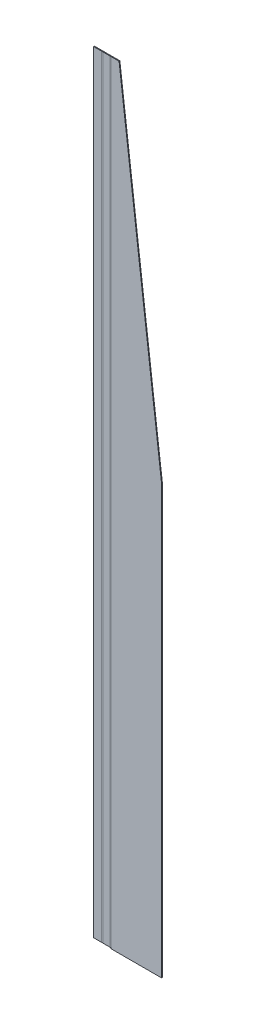
ISO-10303-21;
HEADER;
FILE_DESCRIPTION(('STEP AP214'),'2;1');
FILE_NAME('part.step','',(''),(''),'','','');
FILE_SCHEMA(('AUTOMOTIVE_DESIGN { 1 0 10303 214 1 1 1 1 }'));
ENDSEC;
DATA;
#1=APPLICATION_CONTEXT('core data for automotive mechanical design processes');
#2=APPLICATION_PROTOCOL_DEFINITION('international standard','automotive_design',2000,#1);
#3=PRODUCT_CONTEXT('',#1,'mechanical');
#4=PRODUCT('Part','Part','',(#3));
#5=PRODUCT_RELATED_PRODUCT_CATEGORY('part','',(#4));
#6=PRODUCT_DEFINITION_FORMATION('','',#4);
#7=PRODUCT_DEFINITION_CONTEXT('part definition',#1,'design');
#8=PRODUCT_DEFINITION('design','',#6,#7);
#9=PRODUCT_DEFINITION_SHAPE('','',#8);
#10=(LENGTH_UNIT() NAMED_UNIT(*) SI_UNIT(.MILLI.,.METRE.));
#11=(NAMED_UNIT(*) PLANE_ANGLE_UNIT() SI_UNIT($,.RADIAN.));
#12=(NAMED_UNIT(*) SI_UNIT($,.STERADIAN.) SOLID_ANGLE_UNIT());
#13=UNCERTAINTY_MEASURE_WITH_UNIT(LENGTH_MEASURE(1.E-05),#10,'distance_accuracy_value','');
#14=(GEOMETRIC_REPRESENTATION_CONTEXT(3) GLOBAL_UNCERTAINTY_ASSIGNED_CONTEXT((#13)) GLOBAL_UNIT_ASSIGNED_CONTEXT((#10,
#11,#12)) REPRESENTATION_CONTEXT('',''));
#15=CARTESIAN_POINT('',(0.,0.,0.));
#16=DIRECTION('',(0.,0.,1.));
#17=DIRECTION('',(1.,0.,0.));
#18=AXIS2_PLACEMENT_3D('',#15,#16,#17);
#19=CARTESIAN_POINT('',(-57.8761050847723,1810.,0.));
#20=DIRECTION('',(0.,0.,1.));
#21=DIRECTION('',(1.,0.,0.));
#22=AXIS2_PLACEMENT_3D('',#19,#20,#21);
#23=PLANE('',#22);
#24=DIRECTION('',(0.,-1.,0.));
#25=VECTOR('',#24,1.);
#26=CARTESIAN_POINT('',(-60.5127050847723,1810.,0.));
#27=LINE('',#26,#25);
#28=CARTESIAN_POINT('',(-60.5127050847723,1808.1,0.));
#29=VERTEX_POINT('',#28);
#30=CARTESIAN_POINT('',(-60.5127050847723,1.90000000000001,0.));
#31=VERTEX_POINT('',#30);
#32=EDGE_CURVE('E260',#29,#31,#27,.T.);
#33=ORIENTED_EDGE('',*,*,#32,.F.);
#34=DIRECTION('',(-1.,0.,0.));
#35=VECTOR('',#34,1.);
#36=CARTESIAN_POINT('',(-57.8761050847723,1808.1,0.));
#37=LINE('',#36,#35);
#38=CARTESIAN_POINT('',(-77.1395050847723,1808.1,0.));
#39=VERTEX_POINT('',#38);
#40=EDGE_CURVE('E250',#29,#39,#37,.T.);
#41=ORIENTED_EDGE('',*,*,#40,.T.);
#42=DIRECTION('',(0.,-1.,0.));
#43=VECTOR('',#42,1.);
#44=CARTESIAN_POINT('',(-77.1395050847723,1810.,0.));
#45=LINE('',#44,#43);
#46=CARTESIAN_POINT('',(-77.1395050847723,1.90000000000001,0.));
#47=VERTEX_POINT('',#46);
#48=EDGE_CURVE('E271',#39,#47,#45,.T.);
#49=ORIENTED_EDGE('',*,*,#48,.T.);
#50=DIRECTION('',(-1.,0.,0.));
#51=VECTOR('',#50,1.);
#52=CARTESIAN_POINT('',(-57.8761050847721,1.90000000000001,0.));
#53=LINE('',#52,#51);
#54=EDGE_CURVE('E253',#31,#47,#53,.T.);
#55=ORIENTED_EDGE('',*,*,#54,.F.);
#56=EDGE_LOOP('',(#33,#41,#49,#55));
#57=FACE_BOUND('',#56,.T.);
#58=ADVANCED_FACE('F45',(#57),#23,.T.);
#59=CARTESIAN_POINT('',(-57.8761050847723,1810.,-1.89999999999998));
#60=DIRECTION('',(0.,0.,1.));
#61=DIRECTION('',(1.,0.,0.));
#62=AXIS2_PLACEMENT_3D('',#59,#60,#61);
#63=PLANE('',#62);
#64=DIRECTION('',(-1.,0.,0.));
#65=VECTOR('',#64,1.);
#66=CARTESIAN_POINT('',(-68.8261050847723,1808.1,-1.89999999999998));
#67=LINE('',#66,#65);
#68=CARTESIAN_POINT('',(-60.5127050847723,1808.1,-1.89999999999998));
#69=VERTEX_POINT('',#68);
#70=CARTESIAN_POINT('',(-77.1395050847723,1808.1,-1.89999999999998));
#71=VERTEX_POINT('',#70);
#72=EDGE_CURVE('E67',#69,#71,#67,.T.);
#73=ORIENTED_EDGE('',*,*,#72,.F.);
#74=DIRECTION('',(0.,-1.,0.));
#75=VECTOR('',#74,1.);
#76=CARTESIAN_POINT('',(-60.5127050847723,1810.,-1.89999999999998));
#77=LINE('',#76,#75);
#78=CARTESIAN_POINT('',(-60.5127050847723,1.90000000000001,-1.89999999999998));
#79=VERTEX_POINT('',#78);
#80=EDGE_CURVE('E266',#69,#79,#77,.T.);
#81=ORIENTED_EDGE('',*,*,#80,.T.);
#82=DIRECTION('',(1.,0.,0.));
#83=VECTOR('',#82,1.);
#84=CARTESIAN_POINT('',(-57.8761050847723,1.90000000000001,-1.89999999999998));
#85=LINE('',#84,#83);
#86=CARTESIAN_POINT('',(-77.1395050847723,1.90000000000001,-1.89999999999999));
#87=VERTEX_POINT('',#86);
#88=EDGE_CURVE('E257',#79,#87,#85,.F.);
#89=ORIENTED_EDGE('',*,*,#88,.T.);
#90=DIRECTION('',(0.,-1.,0.));
#91=VECTOR('',#90,1.);
#92=CARTESIAN_POINT('',(-77.1395050847723,1810.,-1.89999999999999));
#93=LINE('',#92,#91);
#94=EDGE_CURVE('E52',#71,#87,#93,.T.);
#95=ORIENTED_EDGE('',*,*,#94,.F.);
#96=EDGE_LOOP('',(#73,#81,#89,#95));
#97=FACE_BOUND('',#96,.T.);
#98=ADVANCED_FACE('F280',(#97),#63,.F.);
#99=CARTESIAN_POINT('',(-57.8761050847721,1.90000000000001,0.));
#100=DIRECTION('',(0.,1.,0.));
#101=DIRECTION('',(-1.,0.,0.));
#102=AXIS2_PLACEMENT_3D('',#99,#100,#101);
#103=PLANE('',#102);
#104=ORIENTED_EDGE('',*,*,#54,.T.);
#105=DIRECTION('',(0.,0.,-1.));
#106=VECTOR('',#105,1.);
#107=CARTESIAN_POINT('',(-77.1395050847723,1.90000000000001,0.));
#108=LINE('',#107,#106);
#109=EDGE_CURVE('E11',#47,#87,#108,.T.);
#110=ORIENTED_EDGE('',*,*,#109,.T.);
#111=ORIENTED_EDGE('',*,*,#88,.F.);
#112=DIRECTION('',(0.,0.,-1.));
#113=VECTOR('',#112,1.);
#114=CARTESIAN_POINT('',(-60.5127050847723,1.90000000000001,0.));
#115=LINE('',#114,#113);
#116=EDGE_CURVE('E263',#31,#79,#115,.T.);
#117=ORIENTED_EDGE('',*,*,#116,.F.);
#118=EDGE_LOOP('',(#104,#110,#111,#117));
#119=FACE_BOUND('',#118,.T.);
#120=ADVANCED_FACE('F283',(#119),#103,.F.);
#121=CARTESIAN_POINT('',(-57.8761050847723,1808.1,0.));
#122=DIRECTION('',(0.,-1.,0.));
#123=DIRECTION('',(-1.,0.,0.));
#124=AXIS2_PLACEMENT_3D('',#121,#122,#123);
#125=PLANE('',#124);
#126=DIRECTION('',(0.,0.,1.));
#127=VECTOR('',#126,1.);
#128=CARTESIAN_POINT('',(-60.5127050847723,1808.1,-1.89999999999998));
#129=LINE('',#128,#127);
#130=EDGE_CURVE('E268',#69,#29,#129,.T.);
#131=ORIENTED_EDGE('',*,*,#130,.F.);
#132=ORIENTED_EDGE('',*,*,#72,.T.);
#133=DIRECTION('',(0.,0.,1.));
#134=VECTOR('',#133,1.);
#135=CARTESIAN_POINT('',(-77.1395050847723,1808.1,-1.89999999999998));
#136=LINE('',#135,#134);
#137=EDGE_CURVE('E274',#71,#39,#136,.T.);
#138=ORIENTED_EDGE('',*,*,#137,.T.);
#139=ORIENTED_EDGE('',*,*,#40,.F.);
#140=EDGE_LOOP('',(#131,#132,#138,#139));
#141=FACE_BOUND('',#140,.T.);
#142=ADVANCED_FACE('F293',(#141),#125,.F.);
#143=CARTESIAN_POINT('',(60.5,1810.,-1.89999999999998));
#144=DIRECTION('',(1.,0.,0.));
#145=DIRECTION('',(0.,0.,-1.));
#146=AXIS2_PLACEMENT_3D('',#143,#144,#145);
#147=PLANE('',#146);
#148=DIRECTION('',(0.,0.,1.));
#149=VECTOR('',#148,1.);
#150=CARTESIAN_POINT('',(60.5,1000.,-21.9));
#151=LINE('',#150,#149);
#152=CARTESIAN_POINT('',(60.5,1000.,-1.89999999999998));
#153=VERTEX_POINT('',#152);
#154=CARTESIAN_POINT('',(60.5,1000.,0.));
#155=VERTEX_POINT('',#154);
#156=EDGE_CURVE('E242',#153,#155,#151,.T.);
#157=ORIENTED_EDGE('',*,*,#156,.T.);
#158=DIRECTION('',(0.,-1.,0.));
#159=VECTOR('',#158,1.);
#160=CARTESIAN_POINT('',(60.5,1810.,0.));
#161=LINE('',#160,#159);
#162=CARTESIAN_POINT('',(60.5,0.,0.));
#163=VERTEX_POINT('',#162);
#164=EDGE_CURVE('E240',#155,#163,#161,.T.);
#165=ORIENTED_EDGE('',*,*,#164,.T.);
#166=DIRECTION('',(0.,0.,1.));
#167=VECTOR('',#166,1.);
#168=CARTESIAN_POINT('',(60.5,0.,-1.89999999999998));
#169=LINE('',#168,#167);
#170=CARTESIAN_POINT('',(60.5,0.,-1.89999999999998));
#171=VERTEX_POINT('',#170);
#172=EDGE_CURVE('E231',#171,#163,#169,.T.);
#173=ORIENTED_EDGE('',*,*,#172,.F.);
#174=DIRECTION('',(0.,-1.,0.));
#175=VECTOR('',#174,1.);
#176=CARTESIAN_POINT('',(60.5,1810.,-1.89999999999998));
#177=LINE('',#176,#175);
#178=EDGE_CURVE('E212',#153,#171,#177,.T.);
#179=ORIENTED_EDGE('',*,*,#178,.F.);
#180=EDGE_LOOP('',(#157,#165,#173,#179));
#181=FACE_BOUND('',#180,.T.);
#182=ADVANCED_FACE('F328',(#181),#147,.T.);
#183=CARTESIAN_POINT('',(-58.6,0.,-2.63659999999998));
#184=DIRECTION('',(0.,-1.,0.));
#185=DIRECTION('',(0.,0.,-1.));
#186=AXIS2_PLACEMENT_3D('',#183,#184,#185);
#187=PLANE('',#186);
#188=DIRECTION('',(-1.,0.,0.));
#189=VECTOR('',#188,1.);
#190=CARTESIAN_POINT('',(60.5,0.,0.));
#191=LINE('',#190,#189);
#192=CARTESIAN_POINT('',(-57.8634,0.,0.));
#193=VERTEX_POINT('',#192);
#194=EDGE_CURVE('E237',#163,#193,#191,.T.);
#195=ORIENTED_EDGE('',*,*,#194,.T.);
#196=DIRECTION('',(0.,0.,-1.));
#197=VECTOR('',#196,1.);
#198=CARTESIAN_POINT('',(-57.8634,0.,0.));
#199=LINE('',#198,#197);
#200=CARTESIAN_POINT('',(-57.8634,0.,-1.89999999999998));
#201=VERTEX_POINT('',#200);
#202=EDGE_CURVE('E234',#193,#201,#199,.T.);
#203=ORIENTED_EDGE('',*,*,#202,.T.);
#204=DIRECTION('',(1.,0.,0.));
#205=VECTOR('',#204,1.);
#206=CARTESIAN_POINT('',(60.5,0.,-1.89999999999998));
#207=LINE('',#206,#205);
#208=EDGE_CURVE('E209',#171,#201,#207,.F.);
#209=ORIENTED_EDGE('',*,*,#208,.F.);
#210=ORIENTED_EDGE('',*,*,#172,.T.);
#211=EDGE_LOOP('',(#195,#203,#209,#210));
#212=FACE_BOUND('',#211,.T.);
#213=ADVANCED_FACE('F349',(#212),#187,.T.);
#214=CARTESIAN_POINT('',(60.5,1000.,-21.9));
#215=DIRECTION('',(-0.992465233221436,-0.122526572002646,0.));
#216=DIRECTION('',(0.122526572002646,-0.992465233221436,0.));
#217=AXIS2_PLACEMENT_3D('',#214,#215,#216);
#218=PLANE('',#217);
#219=DIRECTION('',(0.,0.,-1.));
#220=VECTOR('',#219,1.);
#221=CARTESIAN_POINT('',(-39.2654320987654,1808.1,0.));
#222=LINE('',#221,#220);
#223=CARTESIAN_POINT('',(-39.2654320987654,1808.1,-1.89999999999998));
#224=VERTEX_POINT('',#223);
#225=CARTESIAN_POINT('',(-39.2654320987654,1808.1,0.));
#226=VERTEX_POINT('',#225);
#227=EDGE_CURVE('E228',#224,#226,#222,.F.);
#228=ORIENTED_EDGE('',*,*,#227,.T.);
#229=DIRECTION('',(0.122526572002646,-0.992465233221436,0.));
#230=VECTOR('',#229,1.);
#231=CARTESIAN_POINT('',(60.5,1000.,0.));
#232=LINE('',#231,#230);
#233=EDGE_CURVE('E226',#226,#155,#232,.T.);
#234=ORIENTED_EDGE('',*,*,#233,.T.);
#235=ORIENTED_EDGE('',*,*,#156,.F.);
#236=DIRECTION('',(0.122526572002646,-0.992465233221436,0.));
#237=VECTOR('',#236,1.);
#238=CARTESIAN_POINT('',(-37.998723915328,1797.83966371416,-1.89999999999998));
#239=LINE('',#238,#237);
#240=EDGE_CURVE('E214',#224,#153,#239,.T.);
#241=ORIENTED_EDGE('',*,*,#240,.F.);
#242=EDGE_LOOP('',(#228,#234,#235,#241));
#243=FACE_BOUND('',#242,.T.);
#244=ADVANCED_FACE('F345',(#243),#218,.F.);
#245=CARTESIAN_POINT('',(60.5,1810.,0.));
#246=DIRECTION('',(0.,0.,1.));
#247=DIRECTION('',(1.,0.,0.));
#248=AXIS2_PLACEMENT_3D('',#245,#246,#247);
#249=PLANE('',#248);
#250=ORIENTED_EDGE('',*,*,#233,.F.);
#251=DIRECTION('',(-1.,0.,0.));
#252=VECTOR('',#251,1.);
#253=CARTESIAN_POINT('',(60.5,1808.1,0.));
#254=LINE('',#253,#252);
#255=CARTESIAN_POINT('',(-57.8634,1808.1,0.));
#256=VERTEX_POINT('',#255);
#257=EDGE_CURVE('E224',#226,#256,#254,.T.);
#258=ORIENTED_EDGE('',*,*,#257,.T.);
#259=DIRECTION('',(0.,-1.,0.));
#260=VECTOR('',#259,1.);
#261=CARTESIAN_POINT('',(-57.8634,1810.,0.));
#262=LINE('',#261,#260);
#263=CARTESIAN_POINT('',(-57.8634,1.90000000000001,0.));
#264=VERTEX_POINT('',#263);
#265=EDGE_CURVE('E221',#256,#264,#262,.T.);
#266=ORIENTED_EDGE('',*,*,#265,.T.);
#267=DIRECTION('',(0.,-1.,0.));
#268=VECTOR('',#267,1.);
#269=CARTESIAN_POINT('',(-57.8634,1810.,0.));
#270=LINE('',#269,#268);
#271=EDGE_CURVE('E218',#264,#193,#270,.T.);
#272=ORIENTED_EDGE('',*,*,#271,.T.);
#273=ORIENTED_EDGE('',*,*,#194,.F.);
#274=ORIENTED_EDGE('',*,*,#164,.F.);
#275=EDGE_LOOP('',(#250,#258,#266,#272,#273,#274));
#276=FACE_BOUND('',#275,.T.);
#277=ADVANCED_FACE('F341',(#276),#249,.T.);
#278=CARTESIAN_POINT('',(-57.8634,0.950000000000006,-1.89999999999998));
#279=DIRECTION('',(-1.,0.,0.));
#280=DIRECTION('',(0.,-1.,0.));
#281=AXIS2_PLACEMENT_3D('',#278,#279,#280);
#282=PLANE('',#281);
#283=DIRECTION('',(0.,-1.,0.));
#284=VECTOR('',#283,1.);
#285=CARTESIAN_POINT('',(-57.8634,1810.,-1.89999999999998));
#286=LINE('',#285,#284);
#287=CARTESIAN_POINT('',(-57.8634,1.90000000000001,-1.89999999999998));
#288=VERTEX_POINT('',#287);
#289=EDGE_CURVE('E216',#288,#201,#286,.T.);
#290=ORIENTED_EDGE('',*,*,#289,.T.);
#291=ORIENTED_EDGE('',*,*,#202,.F.);
#292=ORIENTED_EDGE('',*,*,#271,.F.);
#293=DIRECTION('',(0.,0.,1.));
#294=VECTOR('',#293,1.);
#295=CARTESIAN_POINT('',(-57.8634,1.90000000000001,-1.89999999999998));
#296=LINE('',#295,#294);
#297=EDGE_CURVE('E245',#288,#264,#296,.T.);
#298=ORIENTED_EDGE('',*,*,#297,.F.);
#299=EDGE_LOOP('',(#290,#291,#292,#298));
#300=FACE_BOUND('',#299,.T.);
#301=ADVANCED_FACE('F337',(#300),#282,.T.);
#302=CARTESIAN_POINT('',(60.5,1810.,-1.89999999999998));
#303=DIRECTION('',(0.,0.,1.));
#304=DIRECTION('',(1.,0.,0.));
#305=AXIS2_PLACEMENT_3D('',#302,#303,#304);
#306=PLANE('',#305);
#307=DIRECTION('',(-1.,0.,0.));
#308=VECTOR('',#307,1.);
#309=CARTESIAN_POINT('',(-48.5644160493827,1808.1,-1.89999999999998));
#310=LINE('',#309,#308);
#311=CARTESIAN_POINT('',(-57.8634,1808.1,-1.89999999999998));
#312=VERTEX_POINT('',#311);
#313=EDGE_CURVE('E207',#224,#312,#310,.T.);
#314=ORIENTED_EDGE('',*,*,#313,.F.);
#315=ORIENTED_EDGE('',*,*,#240,.T.);
#316=ORIENTED_EDGE('',*,*,#178,.T.);
#317=ORIENTED_EDGE('',*,*,#208,.T.);
#318=ORIENTED_EDGE('',*,*,#289,.F.);
#319=DIRECTION('',(0.,-1.,0.));
#320=VECTOR('',#319,1.);
#321=CARTESIAN_POINT('',(-57.8634,1810.,-1.89999999999998));
#322=LINE('',#321,#320);
#323=EDGE_CURVE('E199',#312,#288,#322,.T.);
#324=ORIENTED_EDGE('',*,*,#323,.F.);
#325=EDGE_LOOP('',(#314,#315,#316,#317,#318,#324));
#326=FACE_BOUND('',#325,.T.);
#327=ADVANCED_FACE('F333',(#326),#306,.F.);
#328=CARTESIAN_POINT('',(60.5,1808.1,0.));
#329=DIRECTION('',(0.,-1.,0.));
#330=DIRECTION('',(-1.,0.,0.));
#331=AXIS2_PLACEMENT_3D('',#328,#329,#330);
#332=PLANE('',#331);
#333=ORIENTED_EDGE('',*,*,#227,.F.);
#334=ORIENTED_EDGE('',*,*,#313,.T.);
#335=DIRECTION('',(0.,0.,1.));
#336=VECTOR('',#335,1.);
#337=CARTESIAN_POINT('',(-57.8634,1808.1,-1.89999999999998));
#338=LINE('',#337,#336);
#339=EDGE_CURVE('E204',#312,#256,#338,.T.);
#340=ORIENTED_EDGE('',*,*,#339,.T.);
#341=ORIENTED_EDGE('',*,*,#257,.F.);
#342=EDGE_LOOP('',(#333,#334,#340,#341));
#343=FACE_BOUND('',#342,.T.);
#344=ADVANCED_FACE('F329',(#343),#332,.F.);
#345=CARTESIAN_POINT('',(-57.8634,1808.1,0.));
#346=DIRECTION('',(0.,1.,0.));
#347=DIRECTION('',(-1.,0.,0.));
#348=AXIS2_PLACEMENT_3D('',#345,#346,#347);
#349=PLANE('',#348);
#350=ORIENTED_EDGE('',*,*,#339,.F.);
#351=DIRECTION('',(1.,0.,0.));
#352=VECTOR('',#351,1.);
#353=CARTESIAN_POINT('',(-59.1880525423861,1808.1,-1.89999999999998));
#354=LINE('',#353,#352);
#355=EDGE_CURVE('E187',#312,#69,#354,.F.);
#356=ORIENTED_EDGE('',*,*,#355,.T.);
#357=ORIENTED_EDGE('',*,*,#130,.T.);
#358=DIRECTION('',(-1.,0.,0.));
#359=VECTOR('',#358,1.);
#360=CARTESIAN_POINT('',(-57.8634,1808.1,0.));
#361=LINE('',#360,#359);
#362=EDGE_CURVE('E192',#256,#29,#361,.T.);
#363=ORIENTED_EDGE('',*,*,#362,.F.);
#364=EDGE_LOOP('',(#350,#356,#357,#363));
#365=FACE_BOUND('',#364,.T.);
#366=ADVANCED_FACE('F332',(#365),#349,.T.);
#367=CARTESIAN_POINT('',(-60.5127050847723,1.90000000000001,0.));
#368=DIRECTION('',(0.,-1.,0.));
#369=DIRECTION('',(1.,0.,0.));
#370=AXIS2_PLACEMENT_3D('',#367,#368,#369);
#371=PLANE('',#370);
#372=DIRECTION('',(1.,0.,0.));
#373=VECTOR('',#372,1.);
#374=CARTESIAN_POINT('',(-59.1880525423861,1.90000000000001,-1.89999999999998));
#375=LINE('',#374,#373);
#376=EDGE_CURVE('E196',#79,#288,#375,.T.);
#377=ORIENTED_EDGE('',*,*,#376,.T.);
#378=ORIENTED_EDGE('',*,*,#297,.T.);
#379=DIRECTION('',(1.,0.,0.));
#380=VECTOR('',#379,1.);
#381=CARTESIAN_POINT('',(-60.5127050847723,1.90000000000001,0.));
#382=LINE('',#381,#380);
#383=EDGE_CURVE('E195',#31,#264,#382,.T.);
#384=ORIENTED_EDGE('',*,*,#383,.F.);
#385=ORIENTED_EDGE('',*,*,#116,.T.);
#386=EDGE_LOOP('',(#377,#378,#384,#385));
#387=FACE_BOUND('',#386,.T.);
#388=ADVANCED_FACE('F357',(#387),#371,.T.);
#389=CARTESIAN_POINT('',(-59.1880525423861,905.,0.));
#390=DIRECTION('',(0.,0.,1.));
#391=DIRECTION('',(1.,0.,0.));
#392=AXIS2_PLACEMENT_3D('',#389,#390,#391);
#393=PLANE('',#392);
#394=ORIENTED_EDGE('',*,*,#32,.T.);
#395=ORIENTED_EDGE('',*,*,#383,.T.);
#396=ORIENTED_EDGE('',*,*,#265,.F.);
#397=ORIENTED_EDGE('',*,*,#362,.T.);
#398=EDGE_LOOP('',(#394,#395,#396,#397));
#399=FACE_BOUND('',#398,.T.);
#400=ADVANCED_FACE('F360',(#399),#393,.T.);
#401=CARTESIAN_POINT('',(-59.1880525423861,905.,-1.89999999999998));
#402=DIRECTION('',(0.,0.,1.));
#403=DIRECTION('',(1.,0.,0.));
#404=AXIS2_PLACEMENT_3D('',#401,#402,#403);
#405=PLANE('',#404);
#406=ORIENTED_EDGE('',*,*,#80,.F.);
#407=ORIENTED_EDGE('',*,*,#355,.F.);
#408=ORIENTED_EDGE('',*,*,#323,.T.);
#409=ORIENTED_EDGE('',*,*,#376,.F.);
#410=EDGE_LOOP('',(#406,#407,#408,#409));
#411=FACE_BOUND('',#410,.T.);
#412=ADVANCED_FACE('F365',(#411),#405,.F.);
#413=CARTESIAN_POINT('',(-77.1395050847723,1808.1,0.));
#414=DIRECTION('',(0.,1.,0.));
#415=DIRECTION('',(-1.,0.,0.));
#416=AXIS2_PLACEMENT_3D('',#413,#414,#415);
#417=PLANE('',#416);
#418=ORIENTED_EDGE('',*,*,#137,.F.);
#419=DIRECTION('',(1.,0.,0.));
#420=VECTOR('',#419,1.);
#421=CARTESIAN_POINT('',(-78.4641576271584,1808.1,-1.89999999999998));
#422=LINE('',#421,#420);
#423=CARTESIAN_POINT('',(-79.7888101695445,1808.1,-1.89999999999997));
#424=VERTEX_POINT('',#423);
#425=EDGE_CURVE('E188',#71,#424,#422,.F.);
#426=ORIENTED_EDGE('',*,*,#425,.T.);
#427=DIRECTION('',(0.,0.,1.));
#428=VECTOR('',#427,1.);
#429=CARTESIAN_POINT('',(-79.7888101695446,1808.1,-1.89999999999996));
#430=LINE('',#429,#428);
#431=CARTESIAN_POINT('',(-79.7888101695445,1808.1,0.));
#432=VERTEX_POINT('',#431);
#433=EDGE_CURVE('E158',#424,#432,#430,.T.);
#434=ORIENTED_EDGE('',*,*,#433,.T.);
#435=DIRECTION('',(-1.,0.,0.));
#436=VECTOR('',#435,1.);
#437=CARTESIAN_POINT('',(-77.1395050847723,1808.1,0.));
#438=LINE('',#437,#436);
#439=EDGE_CURVE('E181',#39,#432,#438,.T.);
#440=ORIENTED_EDGE('',*,*,#439,.F.);
#441=EDGE_LOOP('',(#418,#426,#434,#440));
#442=FACE_BOUND('',#441,.T.);
#443=ADVANCED_FACE('F295',(#442),#417,.T.);
#444=CARTESIAN_POINT('',(-79.7888101695445,1.90000000000001,0.));
#445=DIRECTION('',(0.,-1.,0.));
#446=DIRECTION('',(1.,0.,0.));
#447=AXIS2_PLACEMENT_3D('',#444,#445,#446);
#448=PLANE('',#447);
#449=DIRECTION('',(1.,0.,0.));
#450=VECTOR('',#449,1.);
#451=CARTESIAN_POINT('',(-78.4641576271584,1.90000000000001,-1.89999999999998));
#452=LINE('',#451,#450);
#453=CARTESIAN_POINT('',(-79.7888101695445,1.90000000000001,-1.89999999999997));
#454=VERTEX_POINT('',#453);
#455=EDGE_CURVE('E59',#454,#87,#452,.T.);
#456=ORIENTED_EDGE('',*,*,#455,.T.);
#457=ORIENTED_EDGE('',*,*,#109,.F.);
#458=DIRECTION('',(1.,0.,0.));
#459=VECTOR('',#458,1.);
#460=CARTESIAN_POINT('',(-79.7888101695445,1.90000000000001,0.));
#461=LINE('',#460,#459);
#462=CARTESIAN_POINT('',(-79.7888101695445,1.90000000000001,0.));
#463=VERTEX_POINT('',#462);
#464=EDGE_CURVE('E184',#463,#47,#461,.T.);
#465=ORIENTED_EDGE('',*,*,#464,.F.);
#466=DIRECTION('',(0.,0.,-1.));
#467=VECTOR('',#466,1.);
#468=CARTESIAN_POINT('',(-79.7888101695445,1.90000000000001,0.));
#469=LINE('',#468,#467);
#470=EDGE_CURVE('E178',#463,#454,#469,.T.);
#471=ORIENTED_EDGE('',*,*,#470,.T.);
#472=EDGE_LOOP('',(#456,#457,#465,#471));
#473=FACE_BOUND('',#472,.T.);
#474=ADVANCED_FACE('F286',(#473),#448,.T.);
#475=CARTESIAN_POINT('',(-78.4641576271584,905.,0.));
#476=DIRECTION('',(0.,0.,1.));
#477=DIRECTION('',(1.,0.,0.));
#478=AXIS2_PLACEMENT_3D('',#475,#476,#477);
#479=PLANE('',#478);
#480=DIRECTION('',(0.,-1.,0.));
#481=VECTOR('',#480,1.);
#482=CARTESIAN_POINT('',(-79.7888101695445,1810.,0.));
#483=LINE('',#482,#481);
#484=EDGE_CURVE('E166',#432,#463,#483,.T.);
#485=ORIENTED_EDGE('',*,*,#484,.T.);
#486=ORIENTED_EDGE('',*,*,#464,.T.);
#487=ORIENTED_EDGE('',*,*,#48,.F.);
#488=ORIENTED_EDGE('',*,*,#439,.T.);
#489=EDGE_LOOP('',(#485,#486,#487,#488));
#490=FACE_BOUND('',#489,.T.);
#491=ADVANCED_FACE('F288',(#490),#479,.T.);
#492=CARTESIAN_POINT('',(-78.4641576271584,905.,-1.89999999999998));
#493=DIRECTION('',(0.,0.,1.));
#494=DIRECTION('',(1.,0.,0.));
#495=AXIS2_PLACEMENT_3D('',#492,#493,#494);
#496=PLANE('',#495);
#497=DIRECTION('',(0.,-1.,0.));
#498=VECTOR('',#497,1.);
#499=CARTESIAN_POINT('',(-79.7888101695445,1810.,-1.89999999999997));
#500=LINE('',#499,#498);
#501=EDGE_CURVE('E297',#424,#454,#500,.T.);
#502=ORIENTED_EDGE('',*,*,#501,.F.);
#503=ORIENTED_EDGE('',*,*,#425,.F.);
#504=ORIENTED_EDGE('',*,*,#94,.T.);
#505=ORIENTED_EDGE('',*,*,#455,.F.);
#506=EDGE_LOOP('',(#502,#503,#504,#505));
#507=FACE_BOUND('',#506,.T.);
#508=ADVANCED_FACE('F279',(#507),#496,.F.);
#509=CARTESIAN_POINT('',(-99.0522101695446,1810.,0.));
#510=DIRECTION('',(-1.,0.,0.));
#511=DIRECTION('',(0.,0.,1.));
#512=AXIS2_PLACEMENT_3D('',#509,#510,#511);
#513=PLANE('',#512);
#514=DIRECTION('',(0.,-1.,0.));
#515=VECTOR('',#514,1.);
#516=CARTESIAN_POINT('',(-99.0522101695446,1810.,0.));
#517=LINE('',#516,#515);
#518=CARTESIAN_POINT('',(-99.0522101695446,1808.1,0.));
#519=VERTEX_POINT('',#518);
#520=CARTESIAN_POINT('',(-99.0522101695446,1.90000000000001,0.));
#521=VERTEX_POINT('',#520);
#522=EDGE_CURVE('E163',#519,#521,#517,.T.);
#523=ORIENTED_EDGE('',*,*,#522,.F.);
#524=DIRECTION('',(0.,0.,1.));
#525=VECTOR('',#524,1.);
#526=CARTESIAN_POINT('',(-99.0522101695446,1808.1,-1.89999999999997));
#527=LINE('',#526,#525);
#528=CARTESIAN_POINT('',(-99.0522101695446,1808.1,-1.89999999999997));
#529=VERTEX_POINT('',#528);
#530=EDGE_CURVE('E147',#519,#529,#527,.F.);
#531=ORIENTED_EDGE('',*,*,#530,.T.);
#532=DIRECTION('',(0.,-1.,0.));
#533=VECTOR('',#532,1.);
#534=CARTESIAN_POINT('',(-99.0522101695446,1810.,-1.89999999999997));
#535=LINE('',#534,#533);
#536=CARTESIAN_POINT('',(-99.0522101695446,1.90000000000001,-1.89999999999997));
#537=VERTEX_POINT('',#536);
#538=EDGE_CURVE('E157',#529,#537,#535,.T.);
#539=ORIENTED_EDGE('',*,*,#538,.T.);
#540=DIRECTION('',(0.,0.,1.));
#541=VECTOR('',#540,1.);
#542=CARTESIAN_POINT('',(-99.0522101695446,1.9,0.));
#543=LINE('',#542,#541);
#544=EDGE_CURVE('E172',#521,#537,#543,.F.);
#545=ORIENTED_EDGE('',*,*,#544,.F.);
#546=EDGE_LOOP('',(#523,#531,#539,#545));
#547=FACE_BOUND('',#546,.T.);
#548=ADVANCED_FACE('F170',(#547),#513,.T.);
#549=CARTESIAN_POINT('',(-79.0522101695446,1810.,0.));
#550=DIRECTION('',(0.,0.,1.));
#551=DIRECTION('',(1.,0.,0.));
#552=AXIS2_PLACEMENT_3D('',#549,#550,#551);
#553=PLANE('',#552);
#554=ORIENTED_EDGE('',*,*,#484,.F.);
#555=DIRECTION('',(1.,0.,0.));
#556=VECTOR('',#555,1.);
#557=CARTESIAN_POINT('',(-89.4205101695446,1808.1,0.));
#558=LINE('',#557,#556);
#559=EDGE_CURVE('E151',#519,#432,#558,.T.);
#560=ORIENTED_EDGE('',*,*,#559,.F.);
#561=ORIENTED_EDGE('',*,*,#522,.T.);
#562=DIRECTION('',(-1.,0.,0.));
#563=VECTOR('',#562,1.);
#564=CARTESIAN_POINT('',(-79.0522101695446,1.90000000000001,0.));
#565=LINE('',#564,#563);
#566=EDGE_CURVE('E302',#463,#521,#565,.T.);
#567=ORIENTED_EDGE('',*,*,#566,.F.);
#568=EDGE_LOOP('',(#554,#560,#561,#567));
#569=FACE_BOUND('',#568,.T.);
#570=ADVANCED_FACE('F161',(#569),#553,.T.);
#571=CARTESIAN_POINT('',(-79.0522101695446,1808.1,-1.89999999999997));
#572=DIRECTION('',(0.,-1.,0.));
#573=DIRECTION('',(1.,0.,0.));
#574=AXIS2_PLACEMENT_3D('',#571,#572,#573);
#575=PLANE('',#574);
#576=ORIENTED_EDGE('',*,*,#559,.T.);
#577=ORIENTED_EDGE('',*,*,#433,.F.);
#578=DIRECTION('',(1.,0.,0.));
#579=VECTOR('',#578,1.);
#580=CARTESIAN_POINT('',(-79.0522101695446,1808.1,-1.89999999999997));
#581=LINE('',#580,#579);
#582=EDGE_CURVE('E153',#529,#424,#581,.T.);
#583=ORIENTED_EDGE('',*,*,#582,.F.);
#584=ORIENTED_EDGE('',*,*,#530,.F.);
#585=EDGE_LOOP('',(#576,#577,#583,#584));
#586=FACE_BOUND('',#585,.T.);
#587=ADVANCED_FACE('F149',(#586),#575,.F.);
#588=CARTESIAN_POINT('',(-79.0522101695446,1810.,-1.89999999999997));
#589=DIRECTION('',(0.,0.,1.));
#590=DIRECTION('',(1.,0.,0.));
#591=AXIS2_PLACEMENT_3D('',#588,#589,#590);
#592=PLANE('',#591);
#593=ORIENTED_EDGE('',*,*,#582,.T.);
#594=ORIENTED_EDGE('',*,*,#501,.T.);
#595=DIRECTION('',(1.,0.,0.));
#596=VECTOR('',#595,1.);
#597=CARTESIAN_POINT('',(-79.0522101695446,1.90000000000001,-1.89999999999997));
#598=LINE('',#597,#596);
#599=EDGE_CURVE('E300',#454,#537,#598,.F.);
#600=ORIENTED_EDGE('',*,*,#599,.T.);
#601=ORIENTED_EDGE('',*,*,#538,.F.);
#602=EDGE_LOOP('',(#593,#594,#600,#601));
#603=FACE_BOUND('',#602,.T.);
#604=ADVANCED_FACE('F308',(#603),#592,.F.);
#605=CARTESIAN_POINT('',(-79.0522101695446,1.90000000000001,0.));
#606=DIRECTION('',(0.,1.,0.));
#607=DIRECTION('',(-1.,0.,0.));
#608=AXIS2_PLACEMENT_3D('',#605,#606,#607);
#609=PLANE('',#608);
#610=ORIENTED_EDGE('',*,*,#566,.T.);
#611=ORIENTED_EDGE('',*,*,#544,.T.);
#612=ORIENTED_EDGE('',*,*,#599,.F.);
#613=ORIENTED_EDGE('',*,*,#470,.F.);
#614=EDGE_LOOP('',(#610,#611,#612,#613));
#615=FACE_BOUND('',#614,.T.);
#616=ADVANCED_FACE('F307',(#615),#609,.F.);
#617=CLOSED_SHELL('',(#58,#98,#120,#142,#182,#213,#244,#277,#301,#327,#344,#366,#388,#400,#412,
#443,#474,#491,#508,#548,#570,#587,#604,#616));
#618=MANIFOLD_SOLID_BREP('B2',#617);
#619=ADVANCED_BREP_SHAPE_REPRESENTATION('',(#18,#618),#14);
#620=SHAPE_DEFINITION_REPRESENTATION(#9,#619);
ENDSEC;
END-ISO-10303-21;
